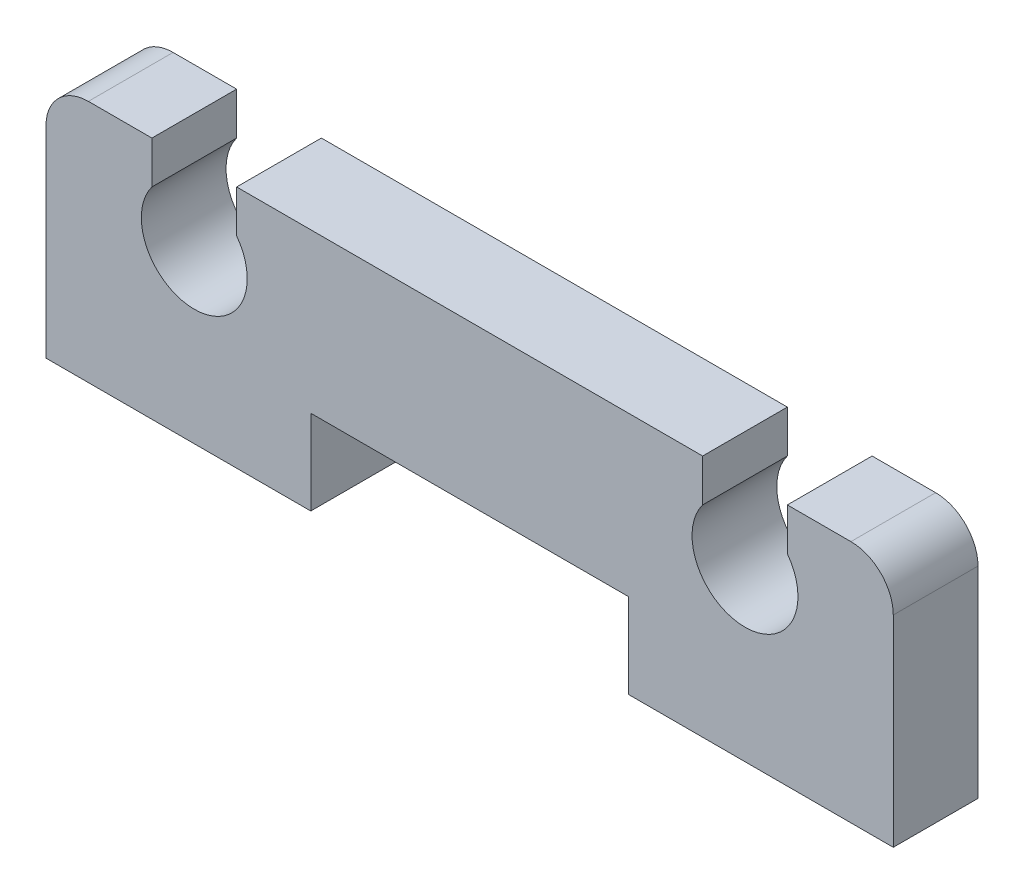
ISO-10303-21;
HEADER;
FILE_DESCRIPTION(('STEP AP214'),'2;1');
FILE_NAME('part.step','',(''),(''),'','','');
FILE_SCHEMA(('AUTOMOTIVE_DESIGN { 1 0 10303 214 1 1 1 1 }'));
ENDSEC;
DATA;
#1=APPLICATION_CONTEXT('core data for automotive mechanical design processes');
#2=APPLICATION_PROTOCOL_DEFINITION('international standard','automotive_design',2000,#1);
#3=PRODUCT_CONTEXT('',#1,'mechanical');
#4=PRODUCT('Part','Part','',(#3));
#5=PRODUCT_RELATED_PRODUCT_CATEGORY('part','',(#4));
#6=PRODUCT_DEFINITION_FORMATION('','',#4);
#7=PRODUCT_DEFINITION_CONTEXT('part definition',#1,'design');
#8=PRODUCT_DEFINITION('design','',#6,#7);
#9=PRODUCT_DEFINITION_SHAPE('','',#8);
#10=(LENGTH_UNIT() NAMED_UNIT(*) SI_UNIT(.MILLI.,.METRE.));
#11=(NAMED_UNIT(*) PLANE_ANGLE_UNIT() SI_UNIT($,.RADIAN.));
#12=(NAMED_UNIT(*) SI_UNIT($,.STERADIAN.) SOLID_ANGLE_UNIT());
#13=UNCERTAINTY_MEASURE_WITH_UNIT(LENGTH_MEASURE(1.E-05),#10,'distance_accuracy_value','');
#14=(GEOMETRIC_REPRESENTATION_CONTEXT(3) GLOBAL_UNCERTAINTY_ASSIGNED_CONTEXT((#13)) GLOBAL_UNIT_ASSIGNED_CONTEXT((#10,
#11,#12)) REPRESENTATION_CONTEXT('',''));
#15=CARTESIAN_POINT('',(0.,0.,0.));
#16=DIRECTION('',(0.,0.,1.));
#17=DIRECTION('',(1.,0.,0.));
#18=AXIS2_PLACEMENT_3D('',#15,#16,#17);
#19=CARTESIAN_POINT('',(-10.,0.,2.));
#20=DIRECTION('',(0.,1.,0.));
#21=DIRECTION('',(0.,0.,1.));
#22=AXIS2_PLACEMENT_3D('',#19,#20,#21);
#23=PLANE('',#22);
#24=DIRECTION('',(1.,0.,0.));
#25=VECTOR('',#24,1.);
#26=CARTESIAN_POINT('',(-10.,0.,0.));
#27=LINE('',#26,#25);
#28=CARTESIAN_POINT('',(-10.,0.,0.));
#29=VERTEX_POINT('',#28);
#30=CARTESIAN_POINT('',(-3.75,0.,0.));
#31=VERTEX_POINT('',#30);
#32=EDGE_CURVE('E180',#29,#31,#27,.T.);
#33=ORIENTED_EDGE('',*,*,#32,.T.);
#34=DIRECTION('',(0.,0.,-1.));
#35=VECTOR('',#34,1.);
#36=CARTESIAN_POINT('',(-3.75,0.,2.));
#37=LINE('',#36,#35);
#38=CARTESIAN_POINT('',(-3.75,0.,2.));
#39=VERTEX_POINT('',#38);
#40=EDGE_CURVE('E162',#39,#31,#37,.T.);
#41=ORIENTED_EDGE('',*,*,#40,.F.);
#42=DIRECTION('',(1.,0.,0.));
#43=VECTOR('',#42,1.);
#44=CARTESIAN_POINT('',(-10.,0.,2.));
#45=LINE('',#44,#43);
#46=CARTESIAN_POINT('',(-10.,0.,2.));
#47=VERTEX_POINT('',#46);
#48=EDGE_CURVE('E168',#47,#39,#45,.T.);
#49=ORIENTED_EDGE('',*,*,#48,.F.);
#50=DIRECTION('',(0.,0.,-1.));
#51=VECTOR('',#50,1.);
#52=CARTESIAN_POINT('',(-10.,0.,2.));
#53=LINE('',#52,#51);
#54=EDGE_CURVE('E213',#47,#29,#53,.T.);
#55=ORIENTED_EDGE('',*,*,#54,.T.);
#56=EDGE_LOOP('',(#33,#41,#49,#55));
#57=FACE_BOUND('',#56,.T.);
#58=ADVANCED_FACE('F33',(#57),#23,.F.);
#59=CARTESIAN_POINT('',(-3.75,0.,2.));
#60=DIRECTION('',(-1.,0.,0.));
#61=DIRECTION('',(0.,0.,1.));
#62=AXIS2_PLACEMENT_3D('',#59,#60,#61);
#63=PLANE('',#62);
#64=DIRECTION('',(0.,1.,0.));
#65=VECTOR('',#64,1.);
#66=CARTESIAN_POINT('',(-3.75,0.,0.));
#67=LINE('',#66,#65);
#68=CARTESIAN_POINT('',(-3.75,2.,0.));
#69=VERTEX_POINT('',#68);
#70=EDGE_CURVE('E262',#31,#69,#67,.T.);
#71=ORIENTED_EDGE('',*,*,#70,.T.);
#72=DIRECTION('',(0.,0.,-1.));
#73=VECTOR('',#72,1.);
#74=CARTESIAN_POINT('',(-3.75,2.,2.));
#75=LINE('',#74,#73);
#76=CARTESIAN_POINT('',(-3.75,2.,2.));
#77=VERTEX_POINT('',#76);
#78=EDGE_CURVE('E165',#77,#69,#75,.T.);
#79=ORIENTED_EDGE('',*,*,#78,.F.);
#80=DIRECTION('',(0.,1.,0.));
#81=VECTOR('',#80,1.);
#82=CARTESIAN_POINT('',(-3.75,0.,2.));
#83=LINE('',#82,#81);
#84=EDGE_CURVE('E158',#39,#77,#83,.T.);
#85=ORIENTED_EDGE('',*,*,#84,.F.);
#86=ORIENTED_EDGE('',*,*,#40,.T.);
#87=EDGE_LOOP('',(#71,#79,#85,#86));
#88=FACE_BOUND('',#87,.T.);
#89=ADVANCED_FACE('F160',(#88),#63,.F.);
#90=CARTESIAN_POINT('',(-3.75,2.,2.));
#91=DIRECTION('',(0.,1.,0.));
#92=DIRECTION('',(-1.,0.,0.));
#93=AXIS2_PLACEMENT_3D('',#90,#91,#92);
#94=PLANE('',#93);
#95=DIRECTION('',(1.,0.,0.));
#96=VECTOR('',#95,1.);
#97=CARTESIAN_POINT('',(-3.75,2.,0.));
#98=LINE('',#97,#96);
#99=CARTESIAN_POINT('',(3.75,2.,0.));
#100=VERTEX_POINT('',#99);
#101=EDGE_CURVE('E256',#69,#100,#98,.T.);
#102=ORIENTED_EDGE('',*,*,#101,.T.);
#103=DIRECTION('',(0.,0.,-1.));
#104=VECTOR('',#103,1.);
#105=CARTESIAN_POINT('',(3.75,2.,2.));
#106=LINE('',#105,#104);
#107=CARTESIAN_POINT('',(3.75,2.,2.));
#108=VERTEX_POINT('',#107);
#109=EDGE_CURVE('E186',#108,#100,#106,.T.);
#110=ORIENTED_EDGE('',*,*,#109,.F.);
#111=DIRECTION('',(1.,0.,0.));
#112=VECTOR('',#111,1.);
#113=CARTESIAN_POINT('',(-3.75,2.,2.));
#114=LINE('',#113,#112);
#115=EDGE_CURVE('E167',#77,#108,#114,.T.);
#116=ORIENTED_EDGE('',*,*,#115,.F.);
#117=ORIENTED_EDGE('',*,*,#78,.T.);
#118=EDGE_LOOP('',(#102,#110,#116,#117));
#119=FACE_BOUND('',#118,.T.);
#120=ADVANCED_FACE('F297',(#119),#94,.F.);
#121=CARTESIAN_POINT('',(3.75,0.,2.));
#122=DIRECTION('',(1.,0.,0.));
#123=DIRECTION('',(0.,1.,0.));
#124=AXIS2_PLACEMENT_3D('',#121,#122,#123);
#125=PLANE('',#124);
#126=DIRECTION('',(0.,-1.,0.));
#127=VECTOR('',#126,1.);
#128=CARTESIAN_POINT('',(3.75,0.,0.));
#129=LINE('',#128,#127);
#130=CARTESIAN_POINT('',(3.75,0.,0.));
#131=VERTEX_POINT('',#130);
#132=EDGE_CURVE('E251',#100,#131,#129,.T.);
#133=ORIENTED_EDGE('',*,*,#132,.T.);
#134=DIRECTION('',(0.,0.,-1.));
#135=VECTOR('',#134,1.);
#136=CARTESIAN_POINT('',(3.75,0.,2.));
#137=LINE('',#136,#135);
#138=CARTESIAN_POINT('',(3.75,0.,2.));
#139=VERTEX_POINT('',#138);
#140=EDGE_CURVE('E242',#139,#131,#137,.T.);
#141=ORIENTED_EDGE('',*,*,#140,.F.);
#142=DIRECTION('',(0.,-1.,0.));
#143=VECTOR('',#142,1.);
#144=CARTESIAN_POINT('',(3.75,0.,2.));
#145=LINE('',#144,#143);
#146=EDGE_CURVE('E252',#108,#139,#145,.T.);
#147=ORIENTED_EDGE('',*,*,#146,.F.);
#148=ORIENTED_EDGE('',*,*,#109,.T.);
#149=EDGE_LOOP('',(#133,#141,#147,#148));
#150=FACE_BOUND('',#149,.T.);
#151=ADVANCED_FACE('F249',(#150),#125,.F.);
#152=CARTESIAN_POINT('',(10.,0.,2.));
#153=DIRECTION('',(0.,1.,0.));
#154=DIRECTION('',(-1.,0.,0.));
#155=AXIS2_PLACEMENT_3D('',#152,#153,#154);
#156=PLANE('',#155);
#157=DIRECTION('',(1.,0.,0.));
#158=VECTOR('',#157,1.);
#159=CARTESIAN_POINT('',(10.,0.,0.));
#160=LINE('',#159,#158);
#161=CARTESIAN_POINT('',(10.,0.,0.));
#162=VERTEX_POINT('',#161);
#163=EDGE_CURVE('E258',#131,#162,#160,.T.);
#164=ORIENTED_EDGE('',*,*,#163,.T.);
#165=DIRECTION('',(0.,0.,-1.));
#166=VECTOR('',#165,1.);
#167=CARTESIAN_POINT('',(10.,0.,2.));
#168=LINE('',#167,#166);
#169=CARTESIAN_POINT('',(10.,0.,2.));
#170=VERTEX_POINT('',#169);
#171=EDGE_CURVE('E239',#170,#162,#168,.T.);
#172=ORIENTED_EDGE('',*,*,#171,.F.);
#173=DIRECTION('',(1.,0.,0.));
#174=VECTOR('',#173,1.);
#175=CARTESIAN_POINT('',(10.,0.,2.));
#176=LINE('',#175,#174);
#177=EDGE_CURVE('E299',#139,#170,#176,.T.);
#178=ORIENTED_EDGE('',*,*,#177,.F.);
#179=ORIENTED_EDGE('',*,*,#140,.T.);
#180=EDGE_LOOP('',(#164,#172,#178,#179));
#181=FACE_BOUND('',#180,.T.);
#182=ADVANCED_FACE('F359',(#181),#156,.F.);
#183=CARTESIAN_POINT('',(10.,0.,2.));
#184=DIRECTION('',(-1.,0.,0.));
#185=DIRECTION('',(0.,0.,1.));
#186=AXIS2_PLACEMENT_3D('',#183,#184,#185);
#187=PLANE('',#186);
#188=DIRECTION('',(0.,1.,0.));
#189=VECTOR('',#188,1.);
#190=CARTESIAN_POINT('',(10.,0.,0.));
#191=LINE('',#190,#189);
#192=CARTESIAN_POINT('',(10.,4.75,0.));
#193=VERTEX_POINT('',#192);
#194=EDGE_CURVE('E260',#162,#193,#191,.T.);
#195=ORIENTED_EDGE('',*,*,#194,.T.);
#196=DIRECTION('',(0.,0.,-1.));
#197=VECTOR('',#196,1.);
#198=CARTESIAN_POINT('',(10.,4.75,2.));
#199=LINE('',#198,#197);
#200=CARTESIAN_POINT('',(10.,4.75,2.));
#201=VERTEX_POINT('',#200);
#202=EDGE_CURVE('E193',#193,#201,#199,.F.);
#203=ORIENTED_EDGE('',*,*,#202,.T.);
#204=DIRECTION('',(0.,1.,0.));
#205=VECTOR('',#204,1.);
#206=CARTESIAN_POINT('',(10.,0.,2.));
#207=LINE('',#206,#205);
#208=EDGE_CURVE('E303',#170,#201,#207,.T.);
#209=ORIENTED_EDGE('',*,*,#208,.F.);
#210=ORIENTED_EDGE('',*,*,#171,.T.);
#211=EDGE_LOOP('',(#195,#203,#209,#210));
#212=FACE_BOUND('',#211,.T.);
#213=ADVANCED_FACE('F352',(#212),#187,.F.);
#214=CARTESIAN_POINT('',(10.,5.75,2.));
#215=DIRECTION('',(0.,-1.,0.));
#216=DIRECTION('',(1.,0.,0.));
#217=AXIS2_PLACEMENT_3D('',#214,#215,#216);
#218=PLANE('',#217);
#219=DIRECTION('',(-1.,0.,0.));
#220=VECTOR('',#219,1.);
#221=CARTESIAN_POINT('',(10.,5.75,2.));
#222=LINE('',#221,#220);
#223=CARTESIAN_POINT('',(9.,5.75,2.));
#224=VERTEX_POINT('',#223);
#225=CARTESIAN_POINT('',(7.5,5.75,2.));
#226=VERTEX_POINT('',#225);
#227=EDGE_CURVE('E305',#224,#226,#222,.T.);
#228=ORIENTED_EDGE('',*,*,#227,.F.);
#229=DIRECTION('',(0.,0.,-1.));
#230=VECTOR('',#229,1.);
#231=CARTESIAN_POINT('',(9.,5.75,2.));
#232=LINE('',#231,#230);
#233=CARTESIAN_POINT('',(9.,5.75,0.));
#234=VERTEX_POINT('',#233);
#235=EDGE_CURVE('E181',#224,#234,#232,.T.);
#236=ORIENTED_EDGE('',*,*,#235,.T.);
#237=DIRECTION('',(-1.,0.,0.));
#238=VECTOR('',#237,1.);
#239=CARTESIAN_POINT('',(10.,5.75,0.));
#240=LINE('',#239,#238);
#241=CARTESIAN_POINT('',(7.5,5.75,0.));
#242=VERTEX_POINT('',#241);
#243=EDGE_CURVE('E268',#234,#242,#240,.T.);
#244=ORIENTED_EDGE('',*,*,#243,.T.);
#245=DIRECTION('',(0.,0.,-1.));
#246=VECTOR('',#245,1.);
#247=CARTESIAN_POINT('',(7.5,5.75,2.));
#248=LINE('',#247,#246);
#249=EDGE_CURVE('E236',#226,#242,#248,.T.);
#250=ORIENTED_EDGE('',*,*,#249,.F.);
#251=EDGE_LOOP('',(#228,#236,#244,#250));
#252=FACE_BOUND('',#251,.T.);
#253=ADVANCED_FACE('F347',(#252),#218,.F.);
#254=CARTESIAN_POINT('',(7.5,4.75,2.));
#255=DIRECTION('',(1.,0.,0.));
#256=DIRECTION('',(0.,1.,0.));
#257=AXIS2_PLACEMENT_3D('',#254,#255,#256);
#258=PLANE('',#257);
#259=DIRECTION('',(0.,-1.,0.));
#260=VECTOR('',#259,1.);
#261=CARTESIAN_POINT('',(7.5,4.75,0.));
#262=LINE('',#261,#260);
#263=CARTESIAN_POINT('',(7.5,4.75,0.));
#264=VERTEX_POINT('',#263);
#265=EDGE_CURVE('E270',#242,#264,#262,.T.);
#266=ORIENTED_EDGE('',*,*,#265,.T.);
#267=DIRECTION('',(0.,0.,-1.));
#268=VECTOR('',#267,1.);
#269=CARTESIAN_POINT('',(7.5,4.75,2.));
#270=LINE('',#269,#268);
#271=CARTESIAN_POINT('',(7.5,4.75,2.));
#272=VERTEX_POINT('',#271);
#273=EDGE_CURVE('E233',#272,#264,#270,.T.);
#274=ORIENTED_EDGE('',*,*,#273,.F.);
#275=DIRECTION('',(0.,-1.,0.));
#276=VECTOR('',#275,1.);
#277=CARTESIAN_POINT('',(7.5,4.75,2.));
#278=LINE('',#277,#276);
#279=EDGE_CURVE('E307',#226,#272,#278,.T.);
#280=ORIENTED_EDGE('',*,*,#279,.F.);
#281=ORIENTED_EDGE('',*,*,#249,.T.);
#282=EDGE_LOOP('',(#266,#274,#280,#281));
#283=FACE_BOUND('',#282,.T.);
#284=ADVANCED_FACE('F343',(#283),#258,.F.);
#285=CARTESIAN_POINT('',(6.5,4.,2.));
#286=DIRECTION('',(0.,0.,-1.));
#287=DIRECTION('',(-1.,0.,0.));
#288=AXIS2_PLACEMENT_3D('',#285,#286,#287);
#289=CYLINDRICAL_SURFACE('',#288,1.25);
#290=CARTESIAN_POINT('',(6.5,4.,0.));
#291=DIRECTION('',(0.,0.,-1.));
#292=DIRECTION('',(-1.,0.,0.));
#293=AXIS2_PLACEMENT_3D('',#290,#291,#292);
#294=CIRCLE('',#293,1.25);
#295=CARTESIAN_POINT('',(5.5,4.75,0.));
#296=VERTEX_POINT('',#295);
#297=EDGE_CURVE('E272',#264,#296,#294,.T.);
#298=ORIENTED_EDGE('',*,*,#297,.T.);
#299=DIRECTION('',(0.,0.,-1.));
#300=VECTOR('',#299,1.);
#301=CARTESIAN_POINT('',(5.5,4.75,2.));
#302=LINE('',#301,#300);
#303=CARTESIAN_POINT('',(5.5,4.75,2.));
#304=VERTEX_POINT('',#303);
#305=EDGE_CURVE('E230',#304,#296,#302,.T.);
#306=ORIENTED_EDGE('',*,*,#305,.F.);
#307=CARTESIAN_POINT('',(6.5,4.,2.));
#308=DIRECTION('',(0.,0.,-1.));
#309=DIRECTION('',(-1.,0.,0.));
#310=AXIS2_PLACEMENT_3D('',#307,#308,#309);
#311=CIRCLE('',#310,1.25);
#312=EDGE_CURVE('E309',#272,#304,#311,.T.);
#313=ORIENTED_EDGE('',*,*,#312,.F.);
#314=ORIENTED_EDGE('',*,*,#273,.T.);
#315=EDGE_LOOP('',(#298,#306,#313,#314));
#316=FACE_BOUND('',#315,.T.);
#317=ADVANCED_FACE('F338',(#316),#289,.F.);
#318=CARTESIAN_POINT('',(5.5,4.75,2.));
#319=DIRECTION('',(-1.,0.,0.));
#320=DIRECTION('',(0.,-1.,0.));
#321=AXIS2_PLACEMENT_3D('',#318,#319,#320);
#322=PLANE('',#321);
#323=DIRECTION('',(0.,1.,0.));
#324=VECTOR('',#323,1.);
#325=CARTESIAN_POINT('',(5.5,4.75,0.));
#326=LINE('',#325,#324);
#327=CARTESIAN_POINT('',(5.5,5.75,0.));
#328=VERTEX_POINT('',#327);
#329=EDGE_CURVE('E274',#296,#328,#326,.T.);
#330=ORIENTED_EDGE('',*,*,#329,.T.);
#331=DIRECTION('',(0.,0.,-1.));
#332=VECTOR('',#331,1.);
#333=CARTESIAN_POINT('',(5.5,5.75,2.));
#334=LINE('',#333,#332);
#335=CARTESIAN_POINT('',(5.5,5.75,2.));
#336=VERTEX_POINT('',#335);
#337=EDGE_CURVE('E227',#336,#328,#334,.T.);
#338=ORIENTED_EDGE('',*,*,#337,.F.);
#339=DIRECTION('',(0.,1.,0.));
#340=VECTOR('',#339,1.);
#341=CARTESIAN_POINT('',(5.5,4.75,2.));
#342=LINE('',#341,#340);
#343=EDGE_CURVE('E311',#304,#336,#342,.T.);
#344=ORIENTED_EDGE('',*,*,#343,.F.);
#345=ORIENTED_EDGE('',*,*,#305,.T.);
#346=EDGE_LOOP('',(#330,#338,#344,#345));
#347=FACE_BOUND('',#346,.T.);
#348=ADVANCED_FACE('F333',(#347),#322,.F.);
#349=CARTESIAN_POINT('',(-5.5,5.75,2.));
#350=DIRECTION('',(0.,-1.,0.));
#351=DIRECTION('',(1.,0.,0.));
#352=AXIS2_PLACEMENT_3D('',#349,#350,#351);
#353=PLANE('',#352);
#354=DIRECTION('',(-1.,0.,0.));
#355=VECTOR('',#354,1.);
#356=CARTESIAN_POINT('',(-5.5,5.75,0.));
#357=LINE('',#356,#355);
#358=CARTESIAN_POINT('',(-5.5,5.75,0.));
#359=VERTEX_POINT('',#358);
#360=EDGE_CURVE('E276',#328,#359,#357,.T.);
#361=ORIENTED_EDGE('',*,*,#360,.T.);
#362=DIRECTION('',(0.,0.,-1.));
#363=VECTOR('',#362,1.);
#364=CARTESIAN_POINT('',(-5.5,5.75,2.));
#365=LINE('',#364,#363);
#366=CARTESIAN_POINT('',(-5.5,5.75,2.));
#367=VERTEX_POINT('',#366);
#368=EDGE_CURVE('E224',#367,#359,#365,.T.);
#369=ORIENTED_EDGE('',*,*,#368,.F.);
#370=DIRECTION('',(-1.,0.,0.));
#371=VECTOR('',#370,1.);
#372=CARTESIAN_POINT('',(-5.5,5.75,2.));
#373=LINE('',#372,#371);
#374=EDGE_CURVE('E313',#336,#367,#373,.T.);
#375=ORIENTED_EDGE('',*,*,#374,.F.);
#376=ORIENTED_EDGE('',*,*,#337,.T.);
#377=EDGE_LOOP('',(#361,#369,#375,#376));
#378=FACE_BOUND('',#377,.T.);
#379=ADVANCED_FACE('F329',(#378),#353,.F.);
#380=CARTESIAN_POINT('',(-5.5,4.75,2.));
#381=DIRECTION('',(1.,0.,0.));
#382=DIRECTION('',(0.,1.,0.));
#383=AXIS2_PLACEMENT_3D('',#380,#381,#382);
#384=PLANE('',#383);
#385=DIRECTION('',(0.,-1.,0.));
#386=VECTOR('',#385,1.);
#387=CARTESIAN_POINT('',(-5.5,4.75,0.));
#388=LINE('',#387,#386);
#389=CARTESIAN_POINT('',(-5.5,4.75,0.));
#390=VERTEX_POINT('',#389);
#391=EDGE_CURVE('E278',#359,#390,#388,.T.);
#392=ORIENTED_EDGE('',*,*,#391,.T.);
#393=DIRECTION('',(0.,0.,-1.));
#394=VECTOR('',#393,1.);
#395=CARTESIAN_POINT('',(-5.5,4.75,2.));
#396=LINE('',#395,#394);
#397=CARTESIAN_POINT('',(-5.5,4.75,2.));
#398=VERTEX_POINT('',#397);
#399=EDGE_CURVE('E221',#398,#390,#396,.T.);
#400=ORIENTED_EDGE('',*,*,#399,.F.);
#401=DIRECTION('',(0.,-1.,0.));
#402=VECTOR('',#401,1.);
#403=CARTESIAN_POINT('',(-5.5,4.75,2.));
#404=LINE('',#403,#402);
#405=EDGE_CURVE('E315',#367,#398,#404,.T.);
#406=ORIENTED_EDGE('',*,*,#405,.F.);
#407=ORIENTED_EDGE('',*,*,#368,.T.);
#408=EDGE_LOOP('',(#392,#400,#406,#407));
#409=FACE_BOUND('',#408,.T.);
#410=ADVANCED_FACE('F325',(#409),#384,.F.);
#411=CARTESIAN_POINT('',(-6.5,4.,2.));
#412=DIRECTION('',(0.,0.,-1.));
#413=DIRECTION('',(-1.,0.,0.));
#414=AXIS2_PLACEMENT_3D('',#411,#412,#413);
#415=CYLINDRICAL_SURFACE('',#414,1.25);
#416=CARTESIAN_POINT('',(-6.5,4.,0.));
#417=DIRECTION('',(0.,0.,-1.));
#418=DIRECTION('',(1.,0.,0.));
#419=AXIS2_PLACEMENT_3D('',#416,#417,#418);
#420=CIRCLE('',#419,1.25);
#421=CARTESIAN_POINT('',(-7.5,4.75,0.));
#422=VERTEX_POINT('',#421);
#423=EDGE_CURVE('E280',#390,#422,#420,.T.);
#424=ORIENTED_EDGE('',*,*,#423,.T.);
#425=DIRECTION('',(0.,0.,-1.));
#426=VECTOR('',#425,1.);
#427=CARTESIAN_POINT('',(-7.5,4.75,2.));
#428=LINE('',#427,#426);
#429=CARTESIAN_POINT('',(-7.5,4.75,2.));
#430=VERTEX_POINT('',#429);
#431=EDGE_CURVE('E218',#430,#422,#428,.T.);
#432=ORIENTED_EDGE('',*,*,#431,.F.);
#433=CARTESIAN_POINT('',(-6.5,4.,2.));
#434=DIRECTION('',(0.,0.,-1.));
#435=DIRECTION('',(1.,0.,0.));
#436=AXIS2_PLACEMENT_3D('',#433,#434,#435);
#437=CIRCLE('',#436,1.25);
#438=EDGE_CURVE('E293',#398,#430,#437,.T.);
#439=ORIENTED_EDGE('',*,*,#438,.F.);
#440=ORIENTED_EDGE('',*,*,#399,.T.);
#441=EDGE_LOOP('',(#424,#432,#439,#440));
#442=FACE_BOUND('',#441,.T.);
#443=ADVANCED_FACE('F320',(#442),#415,.F.);
#444=CARTESIAN_POINT('',(-7.5,4.75,2.));
#445=DIRECTION('',(-1.,0.,0.));
#446=DIRECTION('',(0.,-1.,0.));
#447=AXIS2_PLACEMENT_3D('',#444,#445,#446);
#448=PLANE('',#447);
#449=DIRECTION('',(0.,1.,0.));
#450=VECTOR('',#449,1.);
#451=CARTESIAN_POINT('',(-7.5,4.75,0.));
#452=LINE('',#451,#450);
#453=CARTESIAN_POINT('',(-7.5,5.75,0.));
#454=VERTEX_POINT('',#453);
#455=EDGE_CURVE('E209',#422,#454,#452,.T.);
#456=ORIENTED_EDGE('',*,*,#455,.T.);
#457=DIRECTION('',(0.,0.,-1.));
#458=VECTOR('',#457,1.);
#459=CARTESIAN_POINT('',(-7.5,5.75,2.));
#460=LINE('',#459,#458);
#461=CARTESIAN_POINT('',(-7.5,5.75,2.));
#462=VERTEX_POINT('',#461);
#463=EDGE_CURVE('E215',#462,#454,#460,.T.);
#464=ORIENTED_EDGE('',*,*,#463,.F.);
#465=DIRECTION('',(0.,1.,0.));
#466=VECTOR('',#465,1.);
#467=CARTESIAN_POINT('',(-7.5,4.75,2.));
#468=LINE('',#467,#466);
#469=EDGE_CURVE('E290',#430,#462,#468,.T.);
#470=ORIENTED_EDGE('',*,*,#469,.F.);
#471=ORIENTED_EDGE('',*,*,#431,.T.);
#472=EDGE_LOOP('',(#456,#464,#470,#471));
#473=FACE_BOUND('',#472,.T.);
#474=ADVANCED_FACE('F284',(#473),#448,.F.);
#475=CARTESIAN_POINT('',(-10.,5.75,2.));
#476=DIRECTION('',(0.,-1.,0.));
#477=DIRECTION('',(0.,0.,-1.));
#478=AXIS2_PLACEMENT_3D('',#475,#476,#477);
#479=PLANE('',#478);
#480=DIRECTION('',(-1.,0.,0.));
#481=VECTOR('',#480,1.);
#482=CARTESIAN_POINT('',(-10.,5.75,0.));
#483=LINE('',#482,#481);
#484=CARTESIAN_POINT('',(-9.,5.75,0.));
#485=VERTEX_POINT('',#484);
#486=EDGE_CURVE('E207',#454,#485,#483,.T.);
#487=ORIENTED_EDGE('',*,*,#486,.T.);
#488=DIRECTION('',(0.,0.,-1.));
#489=VECTOR('',#488,1.);
#490=CARTESIAN_POINT('',(-9.,5.75,2.));
#491=LINE('',#490,#489);
#492=CARTESIAN_POINT('',(-9.,5.75,2.));
#493=VERTEX_POINT('',#492);
#494=EDGE_CURVE('E11',#485,#493,#491,.F.);
#495=ORIENTED_EDGE('',*,*,#494,.T.);
#496=DIRECTION('',(-1.,0.,0.));
#497=VECTOR('',#496,1.);
#498=CARTESIAN_POINT('',(-10.,5.75,2.));
#499=LINE('',#498,#497);
#500=EDGE_CURVE('E289',#462,#493,#499,.T.);
#501=ORIENTED_EDGE('',*,*,#500,.F.);
#502=ORIENTED_EDGE('',*,*,#463,.T.);
#503=EDGE_LOOP('',(#487,#495,#501,#502));
#504=FACE_BOUND('',#503,.T.);
#505=ADVANCED_FACE('F288',(#504),#479,.F.);
#506=CARTESIAN_POINT('',(-10.,0.,2.));
#507=DIRECTION('',(1.,0.,0.));
#508=DIRECTION('',(0.,0.,-1.));
#509=AXIS2_PLACEMENT_3D('',#506,#507,#508);
#510=PLANE('',#509);
#511=DIRECTION('',(0.,-1.,0.));
#512=VECTOR('',#511,1.);
#513=CARTESIAN_POINT('',(-10.,0.,2.));
#514=LINE('',#513,#512);
#515=CARTESIAN_POINT('',(-10.,4.75,2.));
#516=VERTEX_POINT('',#515);
#517=EDGE_CURVE('E173',#516,#47,#514,.T.);
#518=ORIENTED_EDGE('',*,*,#517,.F.);
#519=DIRECTION('',(0.,0.,-1.));
#520=VECTOR('',#519,1.);
#521=CARTESIAN_POINT('',(-10.,4.75,2.));
#522=LINE('',#521,#520);
#523=CARTESIAN_POINT('',(-10.,4.75,0.));
#524=VERTEX_POINT('',#523);
#525=EDGE_CURVE('E41',#516,#524,#522,.T.);
#526=ORIENTED_EDGE('',*,*,#525,.T.);
#527=DIRECTION('',(0.,-1.,0.));
#528=VECTOR('',#527,1.);
#529=CARTESIAN_POINT('',(-10.,0.,0.));
#530=LINE('',#529,#528);
#531=EDGE_CURVE('E177',#524,#29,#530,.T.);
#532=ORIENTED_EDGE('',*,*,#531,.T.);
#533=ORIENTED_EDGE('',*,*,#54,.F.);
#534=EDGE_LOOP('',(#518,#526,#532,#533));
#535=FACE_BOUND('',#534,.T.);
#536=ADVANCED_FACE('F201',(#535),#510,.F.);
#537=CARTESIAN_POINT('',(6.5,4.,2.));
#538=DIRECTION('',(0.,0.,-1.));
#539=DIRECTION('',(-1.,0.,0.));
#540=AXIS2_PLACEMENT_3D('',#537,#538,#539);
#541=PLANE('',#540);
#542=ORIENTED_EDGE('',*,*,#208,.T.);
#543=CARTESIAN_POINT('',(9.,4.75,2.));
#544=DIRECTION('',(0.,0.,-1.));
#545=DIRECTION('',(-1.,0.,0.));
#546=AXIS2_PLACEMENT_3D('',#543,#544,#545);
#547=CIRCLE('',#546,1.);
#548=EDGE_CURVE('E196',#201,#224,#547,.F.);
#549=ORIENTED_EDGE('',*,*,#548,.T.);
#550=ORIENTED_EDGE('',*,*,#227,.T.);
#551=ORIENTED_EDGE('',*,*,#279,.T.);
#552=ORIENTED_EDGE('',*,*,#312,.T.);
#553=ORIENTED_EDGE('',*,*,#343,.T.);
#554=ORIENTED_EDGE('',*,*,#374,.T.);
#555=ORIENTED_EDGE('',*,*,#405,.T.);
#556=ORIENTED_EDGE('',*,*,#438,.T.);
#557=ORIENTED_EDGE('',*,*,#469,.T.);
#558=ORIENTED_EDGE('',*,*,#500,.T.);
#559=CARTESIAN_POINT('',(-9.,4.75,2.));
#560=DIRECTION('',(0.,0.,-1.));
#561=DIRECTION('',(-1.,0.,0.));
#562=AXIS2_PLACEMENT_3D('',#559,#560,#561);
#563=CIRCLE('',#562,1.);
#564=EDGE_CURVE('E48',#493,#516,#563,.F.);
#565=ORIENTED_EDGE('',*,*,#564,.T.);
#566=ORIENTED_EDGE('',*,*,#517,.T.);
#567=ORIENTED_EDGE('',*,*,#48,.T.);
#568=ORIENTED_EDGE('',*,*,#84,.T.);
#569=ORIENTED_EDGE('',*,*,#115,.T.);
#570=ORIENTED_EDGE('',*,*,#146,.T.);
#571=ORIENTED_EDGE('',*,*,#177,.T.);
#572=EDGE_LOOP('',(#542,#549,#550,#551,#552,#553,#554,#555,#556,#557,#558,#565,#566,#567,#568,
#569,#570,#571));
#573=FACE_BOUND('',#572,.T.);
#574=ADVANCED_FACE('F172',(#573),#541,.F.);
#575=CARTESIAN_POINT('',(6.5,4.,0.));
#576=DIRECTION('',(0.,0.,-1.));
#577=DIRECTION('',(-1.,0.,0.));
#578=AXIS2_PLACEMENT_3D('',#575,#576,#577);
#579=PLANE('',#578);
#580=ORIENTED_EDGE('',*,*,#243,.F.);
#581=CARTESIAN_POINT('',(9.,4.75,0.));
#582=DIRECTION('',(0.,0.,-1.));
#583=DIRECTION('',(-1.,0.,0.));
#584=AXIS2_PLACEMENT_3D('',#581,#582,#583);
#585=CIRCLE('',#584,1.);
#586=EDGE_CURVE('E191',#234,#193,#585,.T.);
#587=ORIENTED_EDGE('',*,*,#586,.T.);
#588=ORIENTED_EDGE('',*,*,#194,.F.);
#589=ORIENTED_EDGE('',*,*,#163,.F.);
#590=ORIENTED_EDGE('',*,*,#132,.F.);
#591=ORIENTED_EDGE('',*,*,#101,.F.);
#592=ORIENTED_EDGE('',*,*,#70,.F.);
#593=ORIENTED_EDGE('',*,*,#32,.F.);
#594=ORIENTED_EDGE('',*,*,#531,.F.);
#595=CARTESIAN_POINT('',(-9.,4.75,0.));
#596=DIRECTION('',(0.,0.,-1.));
#597=DIRECTION('',(-1.,0.,0.));
#598=AXIS2_PLACEMENT_3D('',#595,#596,#597);
#599=CIRCLE('',#598,1.);
#600=EDGE_CURVE('E184',#524,#485,#599,.T.);
#601=ORIENTED_EDGE('',*,*,#600,.T.);
#602=ORIENTED_EDGE('',*,*,#486,.F.);
#603=ORIENTED_EDGE('',*,*,#455,.F.);
#604=ORIENTED_EDGE('',*,*,#423,.F.);
#605=ORIENTED_EDGE('',*,*,#391,.F.);
#606=ORIENTED_EDGE('',*,*,#360,.F.);
#607=ORIENTED_EDGE('',*,*,#329,.F.);
#608=ORIENTED_EDGE('',*,*,#297,.F.);
#609=ORIENTED_EDGE('',*,*,#265,.F.);
#610=EDGE_LOOP('',(#580,#587,#588,#589,#590,#591,#592,#593,#594,#601,#602,#603,#604,#605,#606,
#607,#608,#609));
#611=FACE_BOUND('',#610,.T.);
#612=ADVANCED_FACE('F205',(#611),#579,.T.);
#613=CARTESIAN_POINT('',(9.,4.75,2.));
#614=DIRECTION('',(0.,0.,-1.));
#615=DIRECTION('',(-1.,0.,0.));
#616=AXIS2_PLACEMENT_3D('',#613,#614,#615);
#617=CYLINDRICAL_SURFACE('',#616,1.);
#618=ORIENTED_EDGE('',*,*,#548,.F.);
#619=ORIENTED_EDGE('',*,*,#202,.F.);
#620=ORIENTED_EDGE('',*,*,#586,.F.);
#621=ORIENTED_EDGE('',*,*,#235,.F.);
#622=EDGE_LOOP('',(#618,#619,#620,#621));
#623=FACE_BOUND('',#622,.T.);
#624=ADVANCED_FACE('F356',(#623),#617,.T.);
#625=CARTESIAN_POINT('',(-9.,4.75,2.));
#626=DIRECTION('',(0.,0.,-1.));
#627=DIRECTION('',(-1.,0.,0.));
#628=AXIS2_PLACEMENT_3D('',#625,#626,#627);
#629=CYLINDRICAL_SURFACE('',#628,1.);
#630=ORIENTED_EDGE('',*,*,#564,.F.);
#631=ORIENTED_EDGE('',*,*,#494,.F.);
#632=ORIENTED_EDGE('',*,*,#600,.F.);
#633=ORIENTED_EDGE('',*,*,#525,.F.);
#634=EDGE_LOOP('',(#630,#631,#632,#633));
#635=FACE_BOUND('',#634,.T.);
#636=ADVANCED_FACE('F35',(#635),#629,.T.);
#637=CLOSED_SHELL('',(#58,#89,#120,#151,#182,#213,#253,#284,#317,#348,#379,#410,#443,#474,#505,
#536,#574,#612,#624,#636));
#638=MANIFOLD_SOLID_BREP('B2',#637);
#639=ADVANCED_BREP_SHAPE_REPRESENTATION('',(#18,#638),#14);
#640=SHAPE_DEFINITION_REPRESENTATION(#9,#639);
ENDSEC;
END-ISO-10303-21;
